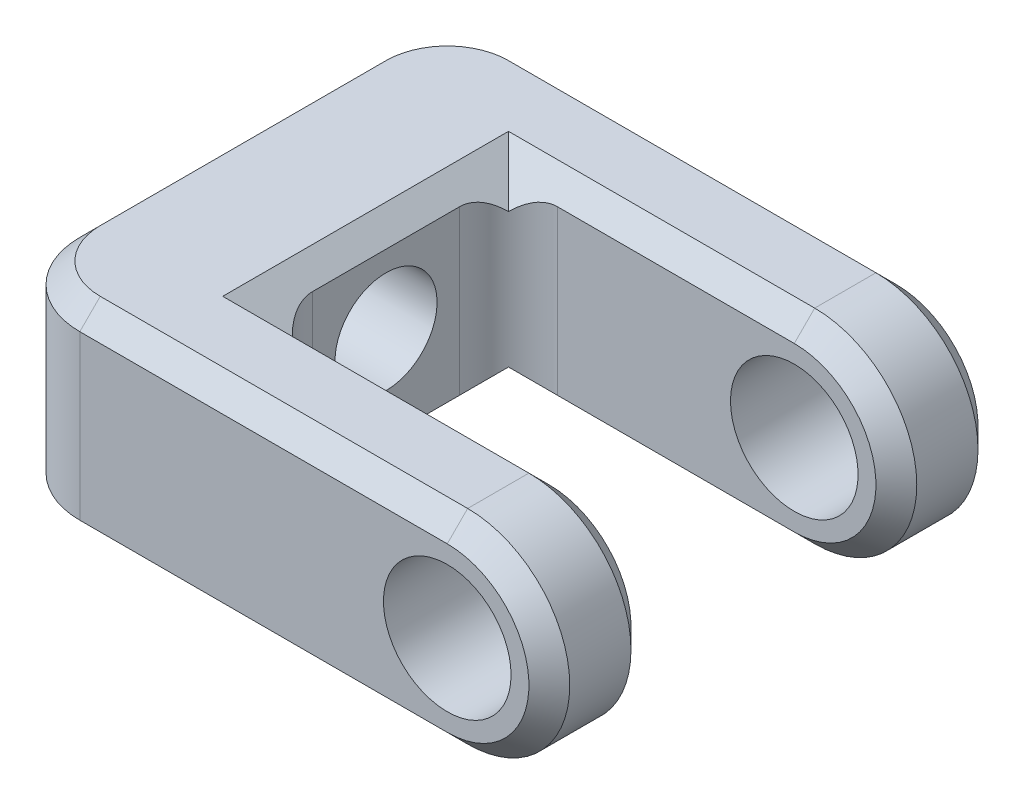
ISO-10303-21;
HEADER;
FILE_DESCRIPTION(('STEP AP214'),'2;1');
FILE_NAME('part.step','',(''),(''),'','','');
FILE_SCHEMA(('AUTOMOTIVE_DESIGN { 1 0 10303 214 1 1 1 1 }'));
ENDSEC;
DATA;
#1=APPLICATION_CONTEXT('core data for automotive mechanical design processes');
#2=APPLICATION_PROTOCOL_DEFINITION('international standard','automotive_design',2000,#1);
#3=PRODUCT_CONTEXT('',#1,'mechanical');
#4=PRODUCT('Part','Part','',(#3));
#5=PRODUCT_RELATED_PRODUCT_CATEGORY('part','',(#4));
#6=PRODUCT_DEFINITION_FORMATION('','',#4);
#7=PRODUCT_DEFINITION_CONTEXT('part definition',#1,'design');
#8=PRODUCT_DEFINITION('design','',#6,#7);
#9=PRODUCT_DEFINITION_SHAPE('','',#8);
#10=(LENGTH_UNIT() NAMED_UNIT(*) SI_UNIT(.MILLI.,.METRE.));
#11=(NAMED_UNIT(*) PLANE_ANGLE_UNIT() SI_UNIT($,.RADIAN.));
#12=(NAMED_UNIT(*) SI_UNIT($,.STERADIAN.) SOLID_ANGLE_UNIT());
#13=UNCERTAINTY_MEASURE_WITH_UNIT(LENGTH_MEASURE(1.E-05),#10,'distance_accuracy_value','');
#14=(GEOMETRIC_REPRESENTATION_CONTEXT(3) GLOBAL_UNCERTAINTY_ASSIGNED_CONTEXT((#13)) GLOBAL_UNIT_ASSIGNED_CONTEXT((#10,
#11,#12)) REPRESENTATION_CONTEXT('',''));
#15=CARTESIAN_POINT('',(0.,0.,0.));
#16=DIRECTION('',(0.,0.,1.));
#17=DIRECTION('',(1.,0.,0.));
#18=AXIS2_PLACEMENT_3D('',#15,#16,#17);
#19=CARTESIAN_POINT('',(34.925,7.9375,34.925));
#20=DIRECTION('',(0.,0.,-1.));
#21=DIRECTION('',(-1.,0.,0.));
#22=AXIS2_PLACEMENT_3D('',#19,#20,#21);
#23=CYLINDRICAL_SURFACE('',#22,7.9375);
#24=DIRECTION('',(0.,0.,-1.));
#25=VECTOR('',#24,1.);
#26=CARTESIAN_POINT('',(34.925,15.875,34.925));
#27=LINE('',#26,#25);
#28=CARTESIAN_POINT('',(34.925,15.875,6.34999999999999));
#29=VERTEX_POINT('',#28);
#30=CARTESIAN_POINT('',(34.925,15.875,1.58750000000001));
#31=VERTEX_POINT('',#30);
#32=EDGE_CURVE('E207',#29,#31,#27,.T.);
#33=ORIENTED_EDGE('',*,*,#32,.F.);
#34=CARTESIAN_POINT('',(34.925,7.9375,6.34999999999999));
#35=DIRECTION('',(0.,0.,-1.));
#36=DIRECTION('',(-1.,0.,0.));
#37=AXIS2_PLACEMENT_3D('',#34,#35,#36);
#38=CIRCLE('',#37,7.9375);
#39=CARTESIAN_POINT('',(34.925,0.,6.34999999999999));
#40=VERTEX_POINT('',#39);
#41=EDGE_CURVE('E202',#29,#40,#38,.T.);
#42=ORIENTED_EDGE('',*,*,#41,.T.);
#43=DIRECTION('',(0.,0.,-1.));
#44=VECTOR('',#43,1.);
#45=CARTESIAN_POINT('',(34.925,0.,34.925));
#46=LINE('',#45,#44);
#47=CARTESIAN_POINT('',(34.925,0.,1.58750000000001));
#48=VERTEX_POINT('',#47);
#49=EDGE_CURVE('E204',#40,#48,#46,.T.);
#50=ORIENTED_EDGE('',*,*,#49,.T.);
#51=CARTESIAN_POINT('',(34.925,7.9375,1.58750000000001));
#52=DIRECTION('',(0.,0.,1.));
#53=DIRECTION('',(1.,0.,0.));
#54=AXIS2_PLACEMENT_3D('',#51,#52,#53);
#55=CIRCLE('',#54,7.9375);
#56=EDGE_CURVE('E213',#48,#31,#55,.T.);
#57=ORIENTED_EDGE('',*,*,#56,.T.);
#58=EDGE_LOOP('',(#33,#42,#50,#57));
#59=FACE_BOUND('',#58,.T.);
#60=ADVANCED_FACE('F39',(#59),#23,.T.);
#61=CARTESIAN_POINT('',(34.925,7.9375,34.925));
#62=DIRECTION('',(0.,0.,-1.));
#63=DIRECTION('',(-1.,0.,0.));
#64=AXIS2_PLACEMENT_3D('',#61,#62,#63);
#65=CYLINDRICAL_SURFACE('',#64,4.9609375);
#66=CARTESIAN_POINT('',(34.925,7.9375,7.9375));
#67=DIRECTION('',(0.,0.,-1.));
#68=DIRECTION('',(-1.,0.,0.));
#69=AXIS2_PLACEMENT_3D('',#66,#67,#68);
#70=CIRCLE('',#69,4.9609375);
#71=CARTESIAN_POINT('',(29.9640625,7.9375,7.9375));
#72=VERTEX_POINT('',#71);
#73=EDGE_CURVE('E423',#72,#72,#70,.T.);
#74=ORIENTED_EDGE('',*,*,#73,.F.);
#75=EDGE_LOOP('',(#74));
#76=FACE_BOUND('',#75,.T.);
#77=CARTESIAN_POINT('',(34.925,7.9375,0.));
#78=DIRECTION('',(0.,0.,1.));
#79=DIRECTION('',(1.,0.,0.));
#80=AXIS2_PLACEMENT_3D('',#77,#78,#79);
#81=CIRCLE('',#80,4.9609375);
#82=CARTESIAN_POINT('',(39.8859375,7.9375,0.));
#83=VERTEX_POINT('',#82);
#84=EDGE_CURVE('E427',#83,#83,#81,.T.);
#85=ORIENTED_EDGE('',*,*,#84,.F.);
#86=EDGE_LOOP('',(#85));
#87=FACE_BOUND('',#86,.T.);
#88=ADVANCED_FACE('F485',(#76,#87),#65,.F.);
#89=CARTESIAN_POINT('',(34.925,7.9375,34.925));
#90=DIRECTION('',(0.,0.,1.));
#91=DIRECTION('',(1.,0.,0.));
#92=AXIS2_PLACEMENT_3D('',#89,#90,#91);
#93=PLANE('',#92);
#94=DIRECTION('',(0.,-1.,0.));
#95=VECTOR('',#94,1.);
#96=CARTESIAN_POINT('',(6.35,0.,34.925));
#97=LINE('',#96,#95);
#98=CARTESIAN_POINT('',(6.35,14.2875,34.925));
#99=VERTEX_POINT('',#98);
#100=CARTESIAN_POINT('',(6.35,1.58750000000001,34.925));
#101=VERTEX_POINT('',#100);
#102=EDGE_CURVE('E435',#99,#101,#97,.T.);
#103=ORIENTED_EDGE('',*,*,#102,.T.);
#104=DIRECTION('',(1.,0.,0.));
#105=VECTOR('',#104,1.);
#106=CARTESIAN_POINT('',(34.925,1.58750000000001,34.925));
#107=LINE('',#106,#105);
#108=CARTESIAN_POINT('',(34.925,1.58750000000001,34.925));
#109=VERTEX_POINT('',#108);
#110=EDGE_CURVE('E269',#101,#109,#107,.T.);
#111=ORIENTED_EDGE('',*,*,#110,.T.);
#112=CARTESIAN_POINT('',(34.925,7.9375,34.925));
#113=DIRECTION('',(0.,0.,1.));
#114=DIRECTION('',(1.,0.,0.));
#115=AXIS2_PLACEMENT_3D('',#112,#113,#114);
#116=CIRCLE('',#115,6.34999999999999);
#117=CARTESIAN_POINT('',(34.925,14.2875,34.925));
#118=VERTEX_POINT('',#117);
#119=EDGE_CURVE('E267',#109,#118,#116,.T.);
#120=ORIENTED_EDGE('',*,*,#119,.T.);
#121=DIRECTION('',(-1.,0.,0.));
#122=VECTOR('',#121,1.);
#123=CARTESIAN_POINT('',(6.35,14.2875,34.925));
#124=LINE('',#123,#122);
#125=EDGE_CURVE('E265',#118,#99,#124,.T.);
#126=ORIENTED_EDGE('',*,*,#125,.T.);
#127=EDGE_LOOP('',(#103,#111,#120,#126));
#128=FACE_BOUND('',#127,.T.);
#129=CARTESIAN_POINT('',(34.925,7.9375,34.925));
#130=DIRECTION('',(0.,0.,1.));
#131=DIRECTION('',(1.,0.,0.));
#132=AXIS2_PLACEMENT_3D('',#129,#130,#131);
#133=CIRCLE('',#132,4.9609375);
#134=CARTESIAN_POINT('',(39.8859375,7.9375,34.925));
#135=VERTEX_POINT('',#134);
#136=EDGE_CURVE('E729',#135,#135,#133,.T.);
#137=ORIENTED_EDGE('',*,*,#136,.F.);
#138=EDGE_LOOP('',(#137));
#139=FACE_BOUND('',#138,.T.);
#140=ADVANCED_FACE('F461',(#128,#139),#93,.T.);
#141=CARTESIAN_POINT('',(34.925,7.9375,0.));
#142=DIRECTION('',(0.,0.,1.));
#143=DIRECTION('',(1.,0.,0.));
#144=AXIS2_PLACEMENT_3D('',#141,#142,#143);
#145=PLANE('',#144);
#146=CARTESIAN_POINT('',(34.925,7.9375,0.));
#147=DIRECTION('',(0.,0.,1.));
#148=DIRECTION('',(1.,0.,0.));
#149=AXIS2_PLACEMENT_3D('',#146,#147,#148);
#150=CIRCLE('',#149,6.34999999999999);
#151=CARTESIAN_POINT('',(34.925,14.2875,0.));
#152=VERTEX_POINT('',#151);
#153=CARTESIAN_POINT('',(34.925,1.58750000000001,0.));
#154=VERTEX_POINT('',#153);
#155=EDGE_CURVE('E278',#152,#154,#150,.F.);
#156=ORIENTED_EDGE('',*,*,#155,.T.);
#157=DIRECTION('',(-1.,0.,0.));
#158=VECTOR('',#157,1.);
#159=CARTESIAN_POINT('',(34.925,1.58750000000001,0.));
#160=LINE('',#159,#158);
#161=CARTESIAN_POINT('',(6.35,1.58750000000001,0.));
#162=VERTEX_POINT('',#161);
#163=EDGE_CURVE('E280',#154,#162,#160,.T.);
#164=ORIENTED_EDGE('',*,*,#163,.T.);
#165=DIRECTION('',(0.,-1.,0.));
#166=VECTOR('',#165,1.);
#167=CARTESIAN_POINT('',(6.35,7.9375,0.));
#168=LINE('',#167,#166);
#169=CARTESIAN_POINT('',(6.35,14.2875,0.));
#170=VERTEX_POINT('',#169);
#171=EDGE_CURVE('E432',#162,#170,#168,.F.);
#172=ORIENTED_EDGE('',*,*,#171,.T.);
#173=DIRECTION('',(1.,0.,0.));
#174=VECTOR('',#173,1.);
#175=CARTESIAN_POINT('',(34.925,14.2875,0.));
#176=LINE('',#175,#174);
#177=EDGE_CURVE('E276',#170,#152,#176,.T.);
#178=ORIENTED_EDGE('',*,*,#177,.T.);
#179=EDGE_LOOP('',(#156,#164,#172,#178));
#180=FACE_BOUND('',#179,.T.);
#181=ORIENTED_EDGE('',*,*,#84,.T.);
#182=EDGE_LOOP('',(#181));
#183=FACE_BOUND('',#182,.T.);
#184=ADVANCED_FACE('F508',(#180,#183),#145,.F.);
#185=CARTESIAN_POINT('',(0.,0.,34.925));
#186=DIRECTION('',(1.,0.,0.));
#187=DIRECTION('',(0.,0.,-1.));
#188=AXIS2_PLACEMENT_3D('',#185,#186,#187);
#189=PLANE('',#188);
#190=CARTESIAN_POINT('',(0.,8.73125,17.4625));
#191=DIRECTION('',(-1.,0.,0.));
#192=DIRECTION('',(0.,0.,1.));
#193=AXIS2_PLACEMENT_3D('',#190,#191,#192);
#194=CIRCLE('',#193,3.96875);
#195=CARTESIAN_POINT('',(0.,8.73125,21.43125));
#196=VERTEX_POINT('',#195);
#197=EDGE_CURVE('E325',#196,#196,#194,.T.);
#198=ORIENTED_EDGE('',*,*,#197,.F.);
#199=EDGE_LOOP('',(#198));
#200=FACE_BOUND('',#199,.T.);
#201=DIRECTION('',(0.,-1.,0.));
#202=VECTOR('',#201,1.);
#203=CARTESIAN_POINT('',(0.,0.,6.35));
#204=LINE('',#203,#202);
#205=CARTESIAN_POINT('',(0.,14.2875,6.35));
#206=VERTEX_POINT('',#205);
#207=CARTESIAN_POINT('',(0.,1.58750000000001,6.35));
#208=VERTEX_POINT('',#207);
#209=EDGE_CURVE('E415',#206,#208,#204,.T.);
#210=ORIENTED_EDGE('',*,*,#209,.T.);
#211=DIRECTION('',(0.,0.,1.));
#212=VECTOR('',#211,1.);
#213=CARTESIAN_POINT('',(0.,1.58750000000001,34.925));
#214=LINE('',#213,#212);
#215=CARTESIAN_POINT('',(0.,1.58750000000001,28.575));
#216=VERTEX_POINT('',#215);
#217=EDGE_CURVE('E288',#208,#216,#214,.T.);
#218=ORIENTED_EDGE('',*,*,#217,.T.);
#219=DIRECTION('',(0.,-1.,0.));
#220=VECTOR('',#219,1.);
#221=CARTESIAN_POINT('',(0.,15.875,28.575));
#222=LINE('',#221,#220);
#223=CARTESIAN_POINT('',(0.,14.2875,28.575));
#224=VERTEX_POINT('',#223);
#225=EDGE_CURVE('E413',#216,#224,#222,.F.);
#226=ORIENTED_EDGE('',*,*,#225,.T.);
#227=DIRECTION('',(0.,0.,-1.));
#228=VECTOR('',#227,1.);
#229=CARTESIAN_POINT('',(0.,14.2875,34.925));
#230=LINE('',#229,#228);
#231=EDGE_CURVE('E286',#224,#206,#230,.T.);
#232=ORIENTED_EDGE('',*,*,#231,.T.);
#233=EDGE_LOOP('',(#210,#218,#226,#232));
#234=FACE_BOUND('',#233,.T.);
#235=ADVANCED_FACE('F504',(#200,#234),#189,.F.);
#236=CARTESIAN_POINT('',(0.,0.,34.925));
#237=DIRECTION('',(0.,1.,0.));
#238=DIRECTION('',(0.,0.,1.));
#239=AXIS2_PLACEMENT_3D('',#236,#237,#238);
#240=PLANE('',#239);
#241=DIRECTION('',(0.,0.,1.));
#242=VECTOR('',#241,1.);
#243=CARTESIAN_POINT('',(11.1125,0.,34.925));
#244=LINE('',#243,#242);
#245=CARTESIAN_POINT('',(11.1125,0.,6.34999999999999));
#246=VERTEX_POINT('',#245);
#247=CARTESIAN_POINT('',(11.1125,0.,28.575));
#248=VERTEX_POINT('',#247);
#249=EDGE_CURVE('E234',#246,#248,#244,.T.);
#250=ORIENTED_EDGE('',*,*,#249,.T.);
#251=DIRECTION('',(1.,0.,0.));
#252=VECTOR('',#251,1.);
#253=CARTESIAN_POINT('',(0.,0.,28.575));
#254=LINE('',#253,#252);
#255=CARTESIAN_POINT('',(34.925,0.,28.575));
#256=VERTEX_POINT('',#255);
#257=EDGE_CURVE('E237',#248,#256,#254,.T.);
#258=ORIENTED_EDGE('',*,*,#257,.T.);
#259=CARTESIAN_POINT('',(34.925,0.,33.3375));
#260=VERTEX_POINT('',#259);
#261=EDGE_CURVE('E221',#260,#256,#46,.T.);
#262=ORIENTED_EDGE('',*,*,#261,.F.);
#263=DIRECTION('',(-1.,0.,0.));
#264=VECTOR('',#263,1.);
#265=CARTESIAN_POINT('',(6.35,0.,33.3375));
#266=LINE('',#265,#264);
#267=CARTESIAN_POINT('',(6.35,0.,33.3375));
#268=VERTEX_POINT('',#267);
#269=EDGE_CURVE('E235',#260,#268,#266,.T.);
#270=ORIENTED_EDGE('',*,*,#269,.T.);
#271=CARTESIAN_POINT('',(6.35,0.,28.575));
#272=DIRECTION('',(0.,1.,0.));
#273=DIRECTION('',(0.,0.,1.));
#274=AXIS2_PLACEMENT_3D('',#271,#272,#273);
#275=CIRCLE('',#274,4.76249999999999);
#276=CARTESIAN_POINT('',(1.58750000000001,0.,28.575));
#277=VERTEX_POINT('',#276);
#278=EDGE_CURVE('E240',#268,#277,#275,.F.);
#279=ORIENTED_EDGE('',*,*,#278,.T.);
#280=DIRECTION('',(0.,0.,-1.));
#281=VECTOR('',#280,1.);
#282=CARTESIAN_POINT('',(1.58750000000001,0.,34.925));
#283=LINE('',#282,#281);
#284=CARTESIAN_POINT('',(1.58750000000001,0.,6.35));
#285=VERTEX_POINT('',#284);
#286=EDGE_CURVE('E438',#277,#285,#283,.T.);
#287=ORIENTED_EDGE('',*,*,#286,.T.);
#288=CARTESIAN_POINT('',(6.35,0.,6.35));
#289=DIRECTION('',(0.,1.,0.));
#290=DIRECTION('',(0.,0.,1.));
#291=AXIS2_PLACEMENT_3D('',#288,#289,#290);
#292=CIRCLE('',#291,4.76249999999999);
#293=CARTESIAN_POINT('',(6.35,0.,1.58750000000001));
#294=VERTEX_POINT('',#293);
#295=EDGE_CURVE('E440',#285,#294,#292,.F.);
#296=ORIENTED_EDGE('',*,*,#295,.T.);
#297=DIRECTION('',(1.,0.,0.));
#298=VECTOR('',#297,1.);
#299=CARTESIAN_POINT('',(0.,0.,1.58750000000001));
#300=LINE('',#299,#298);
#301=EDGE_CURVE('E220',#294,#48,#300,.T.);
#302=ORIENTED_EDGE('',*,*,#301,.T.);
#303=ORIENTED_EDGE('',*,*,#49,.F.);
#304=DIRECTION('',(-1.,0.,0.));
#305=VECTOR('',#304,1.);
#306=CARTESIAN_POINT('',(0.,0.,6.34999999999999));
#307=LINE('',#306,#305);
#308=EDGE_CURVE('E218',#40,#246,#307,.T.);
#309=ORIENTED_EDGE('',*,*,#308,.T.);
#310=EDGE_LOOP('',(#250,#258,#262,#270,#279,#287,#296,#302,#303,#309));
#311=FACE_BOUND('',#310,.T.);
#312=ADVANCED_FACE('F216',(#311),#240,.F.);
#313=ORIENTED_EDGE('',*,*,#261,.T.);
#314=CARTESIAN_POINT('',(34.925,7.9375,28.575));
#315=DIRECTION('',(0.,0.,1.));
#316=DIRECTION('',(1.,0.,0.));
#317=AXIS2_PLACEMENT_3D('',#314,#315,#316);
#318=CIRCLE('',#317,7.9375);
#319=CARTESIAN_POINT('',(34.925,15.875,28.575));
#320=VERTEX_POINT('',#319);
#321=EDGE_CURVE('E292',#256,#320,#318,.T.);
#322=ORIENTED_EDGE('',*,*,#321,.T.);
#323=CARTESIAN_POINT('',(34.925,15.875,33.3375));
#324=VERTEX_POINT('',#323);
#325=EDGE_CURVE('E222',#324,#320,#27,.T.);
#326=ORIENTED_EDGE('',*,*,#325,.F.);
#327=CARTESIAN_POINT('',(34.925,7.9375,33.3375));
#328=DIRECTION('',(0.,0.,1.));
#329=DIRECTION('',(1.,0.,0.));
#330=AXIS2_PLACEMENT_3D('',#327,#328,#329);
#331=CIRCLE('',#330,7.9375);
#332=EDGE_CURVE('E212',#324,#260,#331,.F.);
#333=ORIENTED_EDGE('',*,*,#332,.T.);
#334=EDGE_LOOP('',(#313,#322,#326,#333));
#335=FACE_BOUND('',#334,.T.);
#336=ADVANCED_FACE('F409',(#335),#23,.T.);
#337=CARTESIAN_POINT('',(0.,15.875,34.925));
#338=DIRECTION('',(0.,-1.,0.));
#339=DIRECTION('',(0.,0.,-1.));
#340=AXIS2_PLACEMENT_3D('',#337,#338,#339);
#341=PLANE('',#340);
#342=DIRECTION('',(0.,0.,-1.));
#343=VECTOR('',#342,1.);
#344=CARTESIAN_POINT('',(11.1125,15.875,34.925));
#345=LINE('',#344,#343);
#346=CARTESIAN_POINT('',(11.1125,15.875,28.575));
#347=VERTEX_POINT('',#346);
#348=CARTESIAN_POINT('',(11.1125,15.875,6.34999999999999));
#349=VERTEX_POINT('',#348);
#350=EDGE_CURVE('E306',#347,#349,#345,.T.);
#351=ORIENTED_EDGE('',*,*,#350,.T.);
#352=DIRECTION('',(1.,0.,0.));
#353=VECTOR('',#352,1.);
#354=CARTESIAN_POINT('',(0.,15.875,6.34999999999999));
#355=LINE('',#354,#353);
#356=EDGE_CURVE('E308',#349,#29,#355,.T.);
#357=ORIENTED_EDGE('',*,*,#356,.T.);
#358=ORIENTED_EDGE('',*,*,#32,.T.);
#359=DIRECTION('',(-1.,0.,0.));
#360=VECTOR('',#359,1.);
#361=CARTESIAN_POINT('',(0.,15.875,1.58750000000001));
#362=LINE('',#361,#360);
#363=CARTESIAN_POINT('',(6.35,15.875,1.58750000000001));
#364=VERTEX_POINT('',#363);
#365=EDGE_CURVE('E294',#31,#364,#362,.T.);
#366=ORIENTED_EDGE('',*,*,#365,.T.);
#367=CARTESIAN_POINT('',(6.35,15.875,6.35));
#368=DIRECTION('',(0.,-1.,0.));
#369=DIRECTION('',(0.,0.,-1.));
#370=AXIS2_PLACEMENT_3D('',#367,#368,#369);
#371=CIRCLE('',#370,4.76249999999999);
#372=CARTESIAN_POINT('',(1.58750000000001,15.875,6.35));
#373=VERTEX_POINT('',#372);
#374=EDGE_CURVE('E296',#364,#373,#371,.F.);
#375=ORIENTED_EDGE('',*,*,#374,.T.);
#376=DIRECTION('',(0.,0.,1.));
#377=VECTOR('',#376,1.);
#378=CARTESIAN_POINT('',(1.58750000000001,15.875,34.925));
#379=LINE('',#378,#377);
#380=CARTESIAN_POINT('',(1.58750000000001,15.875,28.575));
#381=VERTEX_POINT('',#380);
#382=EDGE_CURVE('E298',#373,#381,#379,.T.);
#383=ORIENTED_EDGE('',*,*,#382,.T.);
#384=CARTESIAN_POINT('',(6.35,15.875,28.575));
#385=DIRECTION('',(0.,-1.,0.));
#386=DIRECTION('',(0.,0.,-1.));
#387=AXIS2_PLACEMENT_3D('',#384,#385,#386);
#388=CIRCLE('',#387,4.7625);
#389=CARTESIAN_POINT('',(6.35,15.875,33.3375));
#390=VERTEX_POINT('',#389);
#391=EDGE_CURVE('E300',#381,#390,#388,.F.);
#392=ORIENTED_EDGE('',*,*,#391,.T.);
#393=DIRECTION('',(1.,0.,0.));
#394=VECTOR('',#393,1.);
#395=CARTESIAN_POINT('',(34.925,15.875,33.3375));
#396=LINE('',#395,#394);
#397=EDGE_CURVE('E302',#390,#324,#396,.T.);
#398=ORIENTED_EDGE('',*,*,#397,.T.);
#399=ORIENTED_EDGE('',*,*,#325,.T.);
#400=DIRECTION('',(-1.,0.,0.));
#401=VECTOR('',#400,1.);
#402=CARTESIAN_POINT('',(0.,15.875,28.575));
#403=LINE('',#402,#401);
#404=EDGE_CURVE('E304',#320,#347,#403,.T.);
#405=ORIENTED_EDGE('',*,*,#404,.T.);
#406=EDGE_LOOP('',(#351,#357,#358,#366,#375,#383,#392,#398,#399,#405));
#407=FACE_BOUND('',#406,.T.);
#408=ADVANCED_FACE('F498',(#407),#341,.F.);
#409=CARTESIAN_POINT('',(34.925,7.9375,26.9875));
#410=DIRECTION('',(0.,0.,1.));
#411=DIRECTION('',(1.,0.,0.));
#412=AXIS2_PLACEMENT_3D('',#409,#410,#411);
#413=CIRCLE('',#412,4.9609375);
#414=CARTESIAN_POINT('',(39.8859375,7.9375,26.9875));
#415=VERTEX_POINT('',#414);
#416=EDGE_CURVE('E420',#415,#415,#413,.T.);
#417=ORIENTED_EDGE('',*,*,#416,.F.);
#418=EDGE_LOOP('',(#417));
#419=FACE_BOUND('',#418,.T.);
#420=ORIENTED_EDGE('',*,*,#136,.T.);
#421=EDGE_LOOP('',(#420));
#422=FACE_BOUND('',#421,.T.);
#423=ADVANCED_FACE('F494',(#419,#422),#65,.F.);
#424=CARTESIAN_POINT('',(12.7,0.,7.9375));
#425=DIRECTION('',(0.,0.,-1.));
#426=DIRECTION('',(-1.,0.,0.));
#427=AXIS2_PLACEMENT_3D('',#424,#425,#426);
#428=PLANE('',#427);
#429=ORIENTED_EDGE('',*,*,#73,.T.);
#430=EDGE_LOOP('',(#429));
#431=FACE_BOUND('',#430,.T.);
#432=DIRECTION('',(-1.,0.,0.));
#433=VECTOR('',#432,1.);
#434=CARTESIAN_POINT('',(12.7,14.2875,7.9375));
#435=LINE('',#434,#433);
#436=CARTESIAN_POINT('',(34.925,14.2875,7.9375));
#437=VERTEX_POINT('',#436);
#438=CARTESIAN_POINT('',(16.51,14.2875,7.9375));
#439=VERTEX_POINT('',#438);
#440=EDGE_CURVE('E259',#437,#439,#435,.T.);
#441=ORIENTED_EDGE('',*,*,#440,.T.);
#442=DIRECTION('',(0.,1.,0.));
#443=VECTOR('',#442,1.);
#444=CARTESIAN_POINT('',(16.51,1.58750000000001,7.9375));
#445=LINE('',#444,#443);
#446=CARTESIAN_POINT('',(16.51,1.58750000000001,7.9375));
#447=VERTEX_POINT('',#446);
#448=EDGE_CURVE('E366',#439,#447,#445,.F.);
#449=ORIENTED_EDGE('',*,*,#448,.T.);
#450=DIRECTION('',(1.,0.,0.));
#451=VECTOR('',#450,1.);
#452=CARTESIAN_POINT('',(12.7,1.58750000000001,7.9375));
#453=LINE('',#452,#451);
#454=CARTESIAN_POINT('',(34.925,1.5875,7.9375));
#455=VERTEX_POINT('',#454);
#456=EDGE_CURVE('E263',#447,#455,#453,.T.);
#457=ORIENTED_EDGE('',*,*,#456,.T.);
#458=CARTESIAN_POINT('',(34.925,7.9375,7.9375));
#459=DIRECTION('',(0.,0.,-1.));
#460=DIRECTION('',(-1.,0.,0.));
#461=AXIS2_PLACEMENT_3D('',#458,#459,#460);
#462=CIRCLE('',#461,6.35);
#463=EDGE_CURVE('E228',#455,#437,#462,.F.);
#464=ORIENTED_EDGE('',*,*,#463,.T.);
#465=EDGE_LOOP('',(#441,#449,#457,#464));
#466=FACE_BOUND('',#465,.T.);
#467=ADVANCED_FACE('F685',(#431,#466),#428,.F.);
#468=CARTESIAN_POINT('',(12.7,0.,26.9875));
#469=DIRECTION('',(0.,0.,1.));
#470=DIRECTION('',(1.,0.,0.));
#471=AXIS2_PLACEMENT_3D('',#468,#469,#470);
#472=PLANE('',#471);
#473=ORIENTED_EDGE('',*,*,#416,.T.);
#474=EDGE_LOOP('',(#473));
#475=FACE_BOUND('',#474,.T.);
#476=DIRECTION('',(-1.,0.,0.));
#477=VECTOR('',#476,1.);
#478=CARTESIAN_POINT('',(12.7,1.58750000000001,26.9875));
#479=LINE('',#478,#477);
#480=CARTESIAN_POINT('',(34.925,1.5875,26.9875));
#481=VERTEX_POINT('',#480);
#482=CARTESIAN_POINT('',(16.51,1.58750000000001,26.9875));
#483=VERTEX_POINT('',#482);
#484=EDGE_CURVE('E250',#481,#483,#479,.T.);
#485=ORIENTED_EDGE('',*,*,#484,.T.);
#486=DIRECTION('',(0.,1.,0.));
#487=VECTOR('',#486,1.);
#488=CARTESIAN_POINT('',(16.51,14.2875,26.9875));
#489=LINE('',#488,#487);
#490=CARTESIAN_POINT('',(16.51,14.2875,26.9875));
#491=VERTEX_POINT('',#490);
#492=EDGE_CURVE('E310',#483,#491,#489,.T.);
#493=ORIENTED_EDGE('',*,*,#492,.T.);
#494=DIRECTION('',(1.,0.,0.));
#495=VECTOR('',#494,1.);
#496=CARTESIAN_POINT('',(12.7,14.2875,26.9875));
#497=LINE('',#496,#495);
#498=CARTESIAN_POINT('',(34.925,14.2875,26.9875));
#499=VERTEX_POINT('',#498);
#500=EDGE_CURVE('E246',#491,#499,#497,.T.);
#501=ORIENTED_EDGE('',*,*,#500,.T.);
#502=CARTESIAN_POINT('',(34.925,7.9375,26.9875));
#503=DIRECTION('',(0.,0.,1.));
#504=DIRECTION('',(1.,0.,0.));
#505=AXIS2_PLACEMENT_3D('',#502,#503,#504);
#506=CIRCLE('',#505,6.35);
#507=EDGE_CURVE('E248',#499,#481,#506,.F.);
#508=ORIENTED_EDGE('',*,*,#507,.T.);
#509=EDGE_LOOP('',(#485,#493,#501,#508));
#510=FACE_BOUND('',#509,.T.);
#511=ADVANCED_FACE('F697',(#475,#510),#472,.F.);
#512=CARTESIAN_POINT('',(12.7,0.,7.9375));
#513=DIRECTION('',(-1.,0.,0.));
#514=DIRECTION('',(0.,0.,1.));
#515=AXIS2_PLACEMENT_3D('',#512,#513,#514);
#516=PLANE('',#515);
#517=CARTESIAN_POINT('',(12.7,8.73125,17.4625));
#518=DIRECTION('',(-1.,0.,0.));
#519=DIRECTION('',(0.,0.,1.));
#520=AXIS2_PLACEMENT_3D('',#517,#518,#519);
#521=CIRCLE('',#520,3.96875);
#522=CARTESIAN_POINT('',(12.7,8.73125,21.43125));
#523=VERTEX_POINT('',#522);
#524=EDGE_CURVE('E424',#523,#523,#521,.T.);
#525=ORIENTED_EDGE('',*,*,#524,.T.);
#526=EDGE_LOOP('',(#525));
#527=FACE_BOUND('',#526,.T.);
#528=DIRECTION('',(0.,0.,1.));
#529=VECTOR('',#528,1.);
#530=CARTESIAN_POINT('',(12.7,14.2875,7.9375));
#531=LINE('',#530,#529);
#532=CARTESIAN_POINT('',(12.7,14.2875,11.7475));
#533=VERTEX_POINT('',#532);
#534=CARTESIAN_POINT('',(12.7,14.2875,23.1775));
#535=VERTEX_POINT('',#534);
#536=EDGE_CURVE('E253',#533,#535,#531,.T.);
#537=ORIENTED_EDGE('',*,*,#536,.T.);
#538=DIRECTION('',(0.,1.,0.));
#539=VECTOR('',#538,1.);
#540=CARTESIAN_POINT('',(12.7,1.58750000000001,23.1775));
#541=LINE('',#540,#539);
#542=CARTESIAN_POINT('',(12.7,1.58750000000001,23.1775));
#543=VERTEX_POINT('',#542);
#544=EDGE_CURVE('E364',#535,#543,#541,.F.);
#545=ORIENTED_EDGE('',*,*,#544,.T.);
#546=DIRECTION('',(0.,0.,-1.));
#547=VECTOR('',#546,1.);
#548=CARTESIAN_POINT('',(12.7,1.58750000000001,7.9375));
#549=LINE('',#548,#547);
#550=CARTESIAN_POINT('',(12.7,1.58750000000001,11.7475));
#551=VERTEX_POINT('',#550);
#552=EDGE_CURVE('E256',#543,#551,#549,.T.);
#553=ORIENTED_EDGE('',*,*,#552,.T.);
#554=DIRECTION('',(0.,1.,0.));
#555=VECTOR('',#554,1.);
#556=CARTESIAN_POINT('',(12.7,14.2875,11.7475));
#557=LINE('',#556,#555);
#558=EDGE_CURVE('E361',#551,#533,#557,.T.);
#559=ORIENTED_EDGE('',*,*,#558,.T.);
#560=EDGE_LOOP('',(#537,#545,#553,#559));
#561=FACE_BOUND('',#560,.T.);
#562=ADVANCED_FACE('F390',(#527,#561),#516,.F.);
#563=CARTESIAN_POINT('',(42.8625,8.73125,17.4625));
#564=DIRECTION('',(-1.,0.,0.));
#565=DIRECTION('',(0.,0.,1.));
#566=AXIS2_PLACEMENT_3D('',#563,#564,#565);
#567=CYLINDRICAL_SURFACE('',#566,3.96875);
#568=ORIENTED_EDGE('',*,*,#197,.T.);
#569=EDGE_LOOP('',(#568));
#570=FACE_BOUND('',#569,.T.);
#571=ORIENTED_EDGE('',*,*,#524,.F.);
#572=EDGE_LOOP('',(#571));
#573=FACE_BOUND('',#572,.T.);
#574=ADVANCED_FACE('F515',(#570,#573),#567,.F.);
#575=CARTESIAN_POINT('',(6.35,0.,6.35));
#576=DIRECTION('',(0.,-1.,0.));
#577=DIRECTION('',(0.,0.,-1.));
#578=AXIS2_PLACEMENT_3D('',#575,#576,#577);
#579=CYLINDRICAL_SURFACE('',#578,6.35);
#580=ORIENTED_EDGE('',*,*,#171,.F.);
#581=CARTESIAN_POINT('',(6.35,1.58750000000001,6.35));
#582=DIRECTION('',(0.,1.,0.));
#583=DIRECTION('',(0.,0.,1.));
#584=AXIS2_PLACEMENT_3D('',#581,#582,#583);
#585=CIRCLE('',#584,6.35);
#586=EDGE_CURVE('E284',#162,#208,#585,.T.);
#587=ORIENTED_EDGE('',*,*,#586,.T.);
#588=ORIENTED_EDGE('',*,*,#209,.F.);
#589=CARTESIAN_POINT('',(6.35,14.2875,6.35));
#590=DIRECTION('',(0.,-1.,0.));
#591=DIRECTION('',(0.,0.,-1.));
#592=AXIS2_PLACEMENT_3D('',#589,#590,#591);
#593=CIRCLE('',#592,6.35);
#594=EDGE_CURVE('E282',#206,#170,#593,.T.);
#595=ORIENTED_EDGE('',*,*,#594,.T.);
#596=EDGE_LOOP('',(#580,#587,#588,#595));
#597=FACE_BOUND('',#596,.T.);
#598=ADVANCED_FACE('F512',(#597),#579,.T.);
#599=CARTESIAN_POINT('',(6.35,7.9375,28.575));
#600=DIRECTION('',(0.,1.,0.));
#601=DIRECTION('',(0.,0.,1.));
#602=AXIS2_PLACEMENT_3D('',#599,#600,#601);
#603=CYLINDRICAL_SURFACE('',#602,6.35);
#604=ORIENTED_EDGE('',*,*,#225,.F.);
#605=CARTESIAN_POINT('',(6.35,1.58750000000001,28.575));
#606=DIRECTION('',(0.,1.,0.));
#607=DIRECTION('',(0.,0.,1.));
#608=AXIS2_PLACEMENT_3D('',#605,#606,#607);
#609=CIRCLE('',#608,6.35);
#610=EDGE_CURVE('E274',#216,#101,#609,.T.);
#611=ORIENTED_EDGE('',*,*,#610,.T.);
#612=ORIENTED_EDGE('',*,*,#102,.F.);
#613=CARTESIAN_POINT('',(6.35,14.2875,28.575));
#614=DIRECTION('',(0.,-1.,0.));
#615=DIRECTION('',(0.,0.,-1.));
#616=AXIS2_PLACEMENT_3D('',#613,#614,#615);
#617=CIRCLE('',#616,6.35);
#618=EDGE_CURVE('E272',#99,#224,#617,.T.);
#619=ORIENTED_EDGE('',*,*,#618,.T.);
#620=EDGE_LOOP('',(#604,#611,#612,#619));
#621=FACE_BOUND('',#620,.T.);
#622=ADVANCED_FACE('F458',(#621),#603,.T.);
#623=CARTESIAN_POINT('',(12.7,14.2875,7.9375));
#624=DIRECTION('',(0.,-0.707106781186551,-0.707106781186544));
#625=DIRECTION('',(-1.,0.,0.));
#626=AXIS2_PLACEMENT_3D('',#623,#624,#625);
#627=PLANE('',#626);
#628=DIRECTION('',(-0.577350269189628,0.577350269189622,-0.577350269189627));
#629=VECTOR('',#628,1.);
#630=CARTESIAN_POINT('',(12.7,14.2875,7.9375));
#631=LINE('',#630,#629);
#632=CARTESIAN_POINT('',(13.8159231636793,13.1715768363208,9.05342316367925));
#633=VERTEX_POINT('',#632);
#634=EDGE_CURVE('E61',#633,#349,#631,.T.);
#635=ORIENTED_EDGE('',*,*,#634,.F.);
#636=CARTESIAN_POINT('',(16.51,10.4775,11.7475));
#637=DIRECTION('',(0.,-0.707106781186551,-0.707106781186544));
#638=DIRECTION('',(0.,-0.707106781186544,0.707106781186551));
#639=AXIS2_PLACEMENT_3D('',#636,#637,#638);
#640=ELLIPSE('',#639,5.38815367264147,3.81);
#641=EDGE_CURVE('E380',#633,#439,#640,.T.);
#642=ORIENTED_EDGE('',*,*,#641,.T.);
#643=ORIENTED_EDGE('',*,*,#440,.F.);
#644=DIRECTION('',(0.,-0.707106781186544,0.707106781186551));
#645=VECTOR('',#644,1.);
#646=CARTESIAN_POINT('',(34.925,15.875,6.34999999999999));
#647=LINE('',#646,#645);
#648=EDGE_CURVE('E323',#29,#437,#647,.T.);
#649=ORIENTED_EDGE('',*,*,#648,.F.);
#650=ORIENTED_EDGE('',*,*,#356,.F.);
#651=EDGE_LOOP('',(#635,#642,#643,#649,#650));
#652=FACE_BOUND('',#651,.T.);
#653=ADVANCED_FACE('F519',(#652),#627,.F.);
#654=CARTESIAN_POINT('',(34.925,7.9375,6.34999999999999));
#655=DIRECTION('',(0.,0.,-1.));
#656=DIRECTION('',(-1.,0.,0.));
#657=AXIS2_PLACEMENT_3D('',#654,#655,#656);
#658=CONICAL_SURFACE('',#657,7.9375,0.785398163397444);
#659=ORIENTED_EDGE('',*,*,#648,.T.);
#660=ORIENTED_EDGE('',*,*,#463,.F.);
#661=DIRECTION('',(0.,0.707106781186544,0.70710678118655));
#662=VECTOR('',#661,1.);
#663=CARTESIAN_POINT('',(34.925,0.,6.34999999999999));
#664=LINE('',#663,#662);
#665=EDGE_CURVE('E226',#40,#455,#664,.T.);
#666=ORIENTED_EDGE('',*,*,#665,.F.);
#667=ORIENTED_EDGE('',*,*,#41,.F.);
#668=EDGE_LOOP('',(#659,#660,#666,#667));
#669=FACE_BOUND('',#668,.T.);
#670=ADVANCED_FACE('F227',(#669),#658,.T.);
#671=CARTESIAN_POINT('',(12.7,14.2875,7.9375));
#672=DIRECTION('',(-0.707106781186544,-0.707106781186551,0.));
#673=DIRECTION('',(0.,0.,1.));
#674=AXIS2_PLACEMENT_3D('',#671,#672,#673);
#675=PLANE('',#674);
#676=ORIENTED_EDGE('',*,*,#634,.T.);
#677=ORIENTED_EDGE('',*,*,#350,.F.);
#678=DIRECTION('',(-0.577350269189628,0.577350269189622,0.577350269189627));
#679=VECTOR('',#678,1.);
#680=CARTESIAN_POINT('',(19.05,7.93750000000002,20.6375));
#681=LINE('',#680,#679);
#682=CARTESIAN_POINT('',(13.8159231636793,13.1715768363208,25.8715768363207));
#683=VERTEX_POINT('',#682);
#684=EDGE_CURVE('E231',#683,#347,#681,.T.);
#685=ORIENTED_EDGE('',*,*,#684,.F.);
#686=CARTESIAN_POINT('',(16.51,10.4775,23.1775));
#687=DIRECTION('',(-0.707106781186544,-0.707106781186551,0.));
#688=DIRECTION('',(0.707106781186551,-0.707106781186544,0.));
#689=AXIS2_PLACEMENT_3D('',#686,#687,#688);
#690=ELLIPSE('',#689,5.38815367264147,3.81);
#691=EDGE_CURVE('E371',#683,#535,#690,.T.);
#692=ORIENTED_EDGE('',*,*,#691,.T.);
#693=ORIENTED_EDGE('',*,*,#536,.F.);
#694=CARTESIAN_POINT('',(16.51,10.4775,11.7475));
#695=DIRECTION('',(-0.707106781186544,-0.707106781186551,0.));
#696=DIRECTION('',(0.707106781186551,-0.707106781186544,0.));
#697=AXIS2_PLACEMENT_3D('',#694,#695,#696);
#698=ELLIPSE('',#697,5.38815367264147,3.81);
#699=EDGE_CURVE('E378',#533,#633,#698,.T.);
#700=ORIENTED_EDGE('',*,*,#699,.T.);
#701=EDGE_LOOP('',(#676,#677,#685,#692,#693,#700));
#702=FACE_BOUND('',#701,.T.);
#703=ADVANCED_FACE('F535',(#702),#675,.F.);
#704=CARTESIAN_POINT('',(0.,0.,6.34999999999999));
#705=DIRECTION('',(0.,0.707106781186546,-0.707106781186549));
#706=DIRECTION('',(-1.,0.,0.));
#707=AXIS2_PLACEMENT_3D('',#704,#705,#706);
#708=PLANE('',#707);
#709=ORIENTED_EDGE('',*,*,#665,.T.);
#710=ORIENTED_EDGE('',*,*,#456,.F.);
#711=CARTESIAN_POINT('',(16.51,5.39750000000003,11.7475));
#712=DIRECTION('',(0.,0.707106781186546,-0.707106781186549));
#713=DIRECTION('',(0.,-0.707106781186549,-0.707106781186546));
#714=AXIS2_PLACEMENT_3D('',#711,#712,#713);
#715=ELLIPSE('',#714,5.3881536726415,3.81);
#716=CARTESIAN_POINT('',(13.8159231636793,2.70342316367927,9.05342316367925));
#717=VERTEX_POINT('',#716);
#718=EDGE_CURVE('E47',#447,#717,#715,.T.);
#719=ORIENTED_EDGE('',*,*,#718,.T.);
#720=DIRECTION('',(-0.577350269189625,-0.577350269189627,-0.577350269189625));
#721=VECTOR('',#720,1.);
#722=CARTESIAN_POINT('',(20.6375,9.52500000000001,15.875));
#723=LINE('',#722,#721);
#724=EDGE_CURVE('E53',#246,#717,#723,.F.);
#725=ORIENTED_EDGE('',*,*,#724,.F.);
#726=ORIENTED_EDGE('',*,*,#308,.F.);
#727=EDGE_LOOP('',(#709,#710,#719,#725,#726));
#728=FACE_BOUND('',#727,.T.);
#729=ADVANCED_FACE('F233',(#728),#708,.F.);
#730=CARTESIAN_POINT('',(12.7,14.2875,26.9875));
#731=DIRECTION('',(0.,-0.707106781186551,0.707106781186544));
#732=DIRECTION('',(1.,0.,0.));
#733=AXIS2_PLACEMENT_3D('',#730,#731,#732);
#734=PLANE('',#733);
#735=ORIENTED_EDGE('',*,*,#684,.T.);
#736=ORIENTED_EDGE('',*,*,#404,.F.);
#737=DIRECTION('',(0.,0.707106781186544,0.707106781186551));
#738=VECTOR('',#737,1.);
#739=CARTESIAN_POINT('',(34.925,14.2875,26.9875));
#740=LINE('',#739,#738);
#741=EDGE_CURVE('E316',#499,#320,#740,.T.);
#742=ORIENTED_EDGE('',*,*,#741,.F.);
#743=ORIENTED_EDGE('',*,*,#500,.F.);
#744=CARTESIAN_POINT('',(16.51,10.4775,23.1775));
#745=DIRECTION('',(0.,-0.707106781186551,0.707106781186544));
#746=DIRECTION('',(0.,-0.707106781186544,-0.707106781186551));
#747=AXIS2_PLACEMENT_3D('',#744,#745,#746);
#748=ELLIPSE('',#747,5.38815367264147,3.81);
#749=EDGE_CURVE('E368',#491,#683,#748,.T.);
#750=ORIENTED_EDGE('',*,*,#749,.T.);
#751=EDGE_LOOP('',(#735,#736,#742,#743,#750));
#752=FACE_BOUND('',#751,.T.);
#753=ADVANCED_FACE('F529',(#752),#734,.F.);
#754=CARTESIAN_POINT('',(11.1125,0.,34.925));
#755=DIRECTION('',(-0.707106781186549,0.707106781186546,0.));
#756=DIRECTION('',(0.,0.,1.));
#757=AXIS2_PLACEMENT_3D('',#754,#755,#756);
#758=PLANE('',#757);
#759=ORIENTED_EDGE('',*,*,#724,.T.);
#760=CARTESIAN_POINT('',(16.51,5.39750000000003,11.7475));
#761=DIRECTION('',(-0.707106781186549,0.707106781186546,0.));
#762=DIRECTION('',(-0.707106781186546,-0.707106781186549,0.));
#763=AXIS2_PLACEMENT_3D('',#760,#761,#762);
#764=ELLIPSE('',#763,5.3881536726415,3.81);
#765=EDGE_CURVE('E11',#717,#551,#764,.T.);
#766=ORIENTED_EDGE('',*,*,#765,.T.);
#767=ORIENTED_EDGE('',*,*,#552,.F.);
#768=CARTESIAN_POINT('',(16.51,5.39750000000003,23.1775));
#769=DIRECTION('',(-0.707106781186549,0.707106781186546,0.));
#770=DIRECTION('',(-0.707106781186546,-0.707106781186549,0.));
#771=AXIS2_PLACEMENT_3D('',#768,#769,#770);
#772=ELLIPSE('',#771,5.3881536726415,3.81);
#773=CARTESIAN_POINT('',(13.8159231636793,2.70342316367927,25.8715768363207));
#774=VERTEX_POINT('',#773);
#775=EDGE_CURVE('E373',#543,#774,#772,.T.);
#776=ORIENTED_EDGE('',*,*,#775,.T.);
#777=DIRECTION('',(-0.577350269189625,-0.577350269189627,0.577350269189625));
#778=VECTOR('',#777,1.);
#779=CARTESIAN_POINT('',(7.40833333333334,-3.70416666666667,32.2791666666667));
#780=LINE('',#779,#778);
#781=EDGE_CURVE('E313',#248,#774,#780,.F.);
#782=ORIENTED_EDGE('',*,*,#781,.F.);
#783=ORIENTED_EDGE('',*,*,#249,.F.);
#784=EDGE_LOOP('',(#759,#766,#767,#776,#782,#783));
#785=FACE_BOUND('',#784,.T.);
#786=ADVANCED_FACE('F387',(#785),#758,.F.);
#787=CARTESIAN_POINT('',(34.925,7.9375,28.575));
#788=DIRECTION('',(0.,0.,1.));
#789=DIRECTION('',(1.,0.,0.));
#790=AXIS2_PLACEMENT_3D('',#787,#788,#789);
#791=CONICAL_SURFACE('',#790,7.9375,0.785398163397444);
#792=ORIENTED_EDGE('',*,*,#741,.T.);
#793=ORIENTED_EDGE('',*,*,#321,.F.);
#794=DIRECTION('',(0.,-0.707106781186544,0.70710678118655));
#795=VECTOR('',#794,1.);
#796=CARTESIAN_POINT('',(34.925,1.5875,26.9875));
#797=LINE('',#796,#795);
#798=EDGE_CURVE('E311',#481,#256,#797,.T.);
#799=ORIENTED_EDGE('',*,*,#798,.F.);
#800=ORIENTED_EDGE('',*,*,#507,.F.);
#801=EDGE_LOOP('',(#792,#793,#799,#800));
#802=FACE_BOUND('',#801,.T.);
#803=ADVANCED_FACE('F523',(#802),#791,.T.);
#804=CARTESIAN_POINT('',(0.,0.,28.575));
#805=DIRECTION('',(0.,0.707106781186546,0.707106781186549));
#806=DIRECTION('',(1.,0.,0.));
#807=AXIS2_PLACEMENT_3D('',#804,#805,#806);
#808=PLANE('',#807);
#809=ORIENTED_EDGE('',*,*,#781,.T.);
#810=CARTESIAN_POINT('',(16.51,5.39750000000003,23.1775));
#811=DIRECTION('',(0.,0.707106781186546,0.707106781186549));
#812=DIRECTION('',(0.,-0.707106781186549,0.707106781186546));
#813=AXIS2_PLACEMENT_3D('',#810,#811,#812);
#814=ELLIPSE('',#813,5.3881536726415,3.81);
#815=EDGE_CURVE('E376',#774,#483,#814,.T.);
#816=ORIENTED_EDGE('',*,*,#815,.T.);
#817=ORIENTED_EDGE('',*,*,#484,.F.);
#818=ORIENTED_EDGE('',*,*,#798,.T.);
#819=ORIENTED_EDGE('',*,*,#257,.F.);
#820=EDGE_LOOP('',(#809,#816,#817,#818,#819));
#821=FACE_BOUND('',#820,.T.);
#822=ADVANCED_FACE('F401',(#821),#808,.F.);
#823=CARTESIAN_POINT('',(0.,15.875,1.58750000000001));
#824=DIRECTION('',(0.,-0.707106781186546,0.707106781186549));
#825=DIRECTION('',(-1.,0.,0.));
#826=AXIS2_PLACEMENT_3D('',#823,#824,#825);
#827=PLANE('',#826);
#828=DIRECTION('',(0.,-0.707106781186549,-0.707106781186546));
#829=VECTOR('',#828,1.);
#830=CARTESIAN_POINT('',(6.35,15.875,1.58750000000001));
#831=LINE('',#830,#829);
#832=EDGE_CURVE('E354',#364,#170,#831,.T.);
#833=ORIENTED_EDGE('',*,*,#832,.F.);
#834=ORIENTED_EDGE('',*,*,#365,.F.);
#835=DIRECTION('',(0.,0.707106781186549,0.707106781186546));
#836=VECTOR('',#835,1.);
#837=CARTESIAN_POINT('',(34.925,14.2875,0.));
#838=LINE('',#837,#836);
#839=EDGE_CURVE('E314',#152,#31,#838,.T.);
#840=ORIENTED_EDGE('',*,*,#839,.F.);
#841=ORIENTED_EDGE('',*,*,#177,.F.);
#842=EDGE_LOOP('',(#833,#834,#840,#841));
#843=FACE_BOUND('',#842,.T.);
#844=ADVANCED_FACE('F522',(#843),#827,.F.);
#845=CARTESIAN_POINT('',(34.925,7.9375,1.58750000000001));
#846=DIRECTION('',(0.,0.,1.));
#847=DIRECTION('',(1.,0.,0.));
#848=AXIS2_PLACEMENT_3D('',#845,#846,#847);
#849=CONICAL_SURFACE('',#848,7.9375,0.78539816339745);
#850=ORIENTED_EDGE('',*,*,#839,.T.);
#851=ORIENTED_EDGE('',*,*,#56,.F.);
#852=DIRECTION('',(0.,-0.707106781186549,0.707106781186546));
#853=VECTOR('',#852,1.);
#854=CARTESIAN_POINT('',(34.925,1.58750000000001,0.));
#855=LINE('',#854,#853);
#856=EDGE_CURVE('E351',#154,#48,#855,.T.);
#857=ORIENTED_EDGE('',*,*,#856,.F.);
#858=ORIENTED_EDGE('',*,*,#155,.F.);
#859=EDGE_LOOP('',(#850,#851,#857,#858));
#860=FACE_BOUND('',#859,.T.);
#861=ADVANCED_FACE('F644',(#860),#849,.T.);
#862=CARTESIAN_POINT('',(6.35,15.875,6.35));
#863=DIRECTION('',(0.,-1.,0.));
#864=DIRECTION('',(0.,0.,-1.));
#865=AXIS2_PLACEMENT_3D('',#862,#863,#864);
#866=CONICAL_SURFACE('',#865,4.76249999999999,0.785398163397446);
#867=ORIENTED_EDGE('',*,*,#832,.T.);
#868=ORIENTED_EDGE('',*,*,#594,.F.);
#869=DIRECTION('',(-0.707106781186546,-0.707106781186549,0.));
#870=VECTOR('',#869,1.);
#871=CARTESIAN_POINT('',(1.58750000000001,15.875,6.35));
#872=LINE('',#871,#870);
#873=EDGE_CURVE('E348',#373,#206,#872,.T.);
#874=ORIENTED_EDGE('',*,*,#873,.F.);
#875=ORIENTED_EDGE('',*,*,#374,.F.);
#876=EDGE_LOOP('',(#867,#868,#874,#875));
#877=FACE_BOUND('',#876,.T.);
#878=ADVANCED_FACE('F636',(#877),#866,.T.);
#879=CARTESIAN_POINT('',(0.,0.,1.58750000000001));
#880=DIRECTION('',(0.,0.707106781186546,0.707106781186549));
#881=DIRECTION('',(1.,0.,0.));
#882=AXIS2_PLACEMENT_3D('',#879,#880,#881);
#883=PLANE('',#882);
#884=ORIENTED_EDGE('',*,*,#856,.T.);
#885=ORIENTED_EDGE('',*,*,#301,.F.);
#886=DIRECTION('',(0.,-0.707106781186549,0.707106781186546));
#887=VECTOR('',#886,1.);
#888=CARTESIAN_POINT('',(6.35,1.58750000000001,0.));
#889=LINE('',#888,#887);
#890=EDGE_CURVE('E345',#162,#294,#889,.T.);
#891=ORIENTED_EDGE('',*,*,#890,.F.);
#892=ORIENTED_EDGE('',*,*,#163,.F.);
#893=EDGE_LOOP('',(#884,#885,#891,#892));
#894=FACE_BOUND('',#893,.T.);
#895=ADVANCED_FACE('F628',(#894),#883,.F.);
#896=CARTESIAN_POINT('',(0.,14.2875,34.925));
#897=DIRECTION('',(0.707106781186549,-0.707106781186546,0.));
#898=DIRECTION('',(0.,0.,-1.));
#899=AXIS2_PLACEMENT_3D('',#896,#897,#898);
#900=PLANE('',#899);
#901=ORIENTED_EDGE('',*,*,#873,.T.);
#902=ORIENTED_EDGE('',*,*,#231,.F.);
#903=DIRECTION('',(-0.707106781186546,-0.707106781186549,0.));
#904=VECTOR('',#903,1.);
#905=CARTESIAN_POINT('',(1.58750000000001,15.875,28.575));
#906=LINE('',#905,#904);
#907=EDGE_CURVE('E342',#381,#224,#906,.T.);
#908=ORIENTED_EDGE('',*,*,#907,.F.);
#909=ORIENTED_EDGE('',*,*,#382,.F.);
#910=EDGE_LOOP('',(#901,#902,#908,#909));
#911=FACE_BOUND('',#910,.T.);
#912=ADVANCED_FACE('F620',(#911),#900,.F.);
#913=CARTESIAN_POINT('',(6.35,0.,6.35));
#914=DIRECTION('',(0.,1.,0.));
#915=DIRECTION('',(0.,0.,1.));
#916=AXIS2_PLACEMENT_3D('',#913,#914,#915);
#917=CONICAL_SURFACE('',#916,4.76249999999999,0.785398163397446);
#918=ORIENTED_EDGE('',*,*,#890,.T.);
#919=ORIENTED_EDGE('',*,*,#295,.F.);
#920=DIRECTION('',(0.707106781186546,-0.707106781186549,0.));
#921=VECTOR('',#920,1.);
#922=CARTESIAN_POINT('',(0.,1.58750000000001,6.35));
#923=LINE('',#922,#921);
#924=EDGE_CURVE('E339',#208,#285,#923,.T.);
#925=ORIENTED_EDGE('',*,*,#924,.F.);
#926=ORIENTED_EDGE('',*,*,#586,.F.);
#927=EDGE_LOOP('',(#918,#919,#925,#926));
#928=FACE_BOUND('',#927,.T.);
#929=ADVANCED_FACE('F612',(#928),#917,.T.);
#930=CARTESIAN_POINT('',(6.35,15.875,28.575));
#931=DIRECTION('',(0.,-1.,0.));
#932=DIRECTION('',(0.,0.,-1.));
#933=AXIS2_PLACEMENT_3D('',#930,#931,#932);
#934=CONICAL_SURFACE('',#933,4.7625,0.785398163397446);
#935=ORIENTED_EDGE('',*,*,#907,.T.);
#936=ORIENTED_EDGE('',*,*,#618,.F.);
#937=DIRECTION('',(0.,-0.707106781186549,0.707106781186546));
#938=VECTOR('',#937,1.);
#939=CARTESIAN_POINT('',(6.35,15.875,33.3375));
#940=LINE('',#939,#938);
#941=EDGE_CURVE('E336',#390,#99,#940,.T.);
#942=ORIENTED_EDGE('',*,*,#941,.F.);
#943=ORIENTED_EDGE('',*,*,#391,.F.);
#944=EDGE_LOOP('',(#935,#936,#942,#943));
#945=FACE_BOUND('',#944,.T.);
#946=ADVANCED_FACE('F605',(#945),#934,.T.);
#947=CARTESIAN_POINT('',(1.58750000000001,0.,34.925));
#948=DIRECTION('',(0.707106781186549,0.707106781186546,0.));
#949=DIRECTION('',(0.,0.,-1.));
#950=AXIS2_PLACEMENT_3D('',#947,#948,#949);
#951=PLANE('',#950);
#952=ORIENTED_EDGE('',*,*,#924,.T.);
#953=ORIENTED_EDGE('',*,*,#286,.F.);
#954=DIRECTION('',(0.707106781186546,-0.707106781186549,0.));
#955=VECTOR('',#954,1.);
#956=CARTESIAN_POINT('',(0.,1.58750000000001,28.575));
#957=LINE('',#956,#955);
#958=EDGE_CURVE('E333',#216,#277,#957,.T.);
#959=ORIENTED_EDGE('',*,*,#958,.F.);
#960=ORIENTED_EDGE('',*,*,#217,.F.);
#961=EDGE_LOOP('',(#952,#953,#959,#960));
#962=FACE_BOUND('',#961,.T.);
#963=ADVANCED_FACE('F449',(#962),#951,.F.);
#964=CARTESIAN_POINT('',(34.925,14.2875,34.925));
#965=DIRECTION('',(0.,0.707106781186546,0.707106781186549));
#966=DIRECTION('',(1.,0.,0.));
#967=AXIS2_PLACEMENT_3D('',#964,#965,#966);
#968=PLANE('',#967);
#969=ORIENTED_EDGE('',*,*,#941,.T.);
#970=ORIENTED_EDGE('',*,*,#125,.F.);
#971=DIRECTION('',(0.,-0.707106781186549,0.707106781186546));
#972=VECTOR('',#971,1.);
#973=CARTESIAN_POINT('',(34.925,15.875,33.3375));
#974=LINE('',#973,#972);
#975=EDGE_CURVE('E330',#324,#118,#974,.T.);
#976=ORIENTED_EDGE('',*,*,#975,.F.);
#977=ORIENTED_EDGE('',*,*,#397,.F.);
#978=EDGE_LOOP('',(#969,#970,#976,#977));
#979=FACE_BOUND('',#978,.T.);
#980=ADVANCED_FACE('F467',(#979),#968,.T.);
#981=CARTESIAN_POINT('',(6.35,0.,28.575));
#982=DIRECTION('',(0.,1.,0.));
#983=DIRECTION('',(0.,0.,1.));
#984=AXIS2_PLACEMENT_3D('',#981,#982,#983);
#985=CONICAL_SURFACE('',#984,4.76249999999999,0.785398163397446);
#986=ORIENTED_EDGE('',*,*,#958,.T.);
#987=ORIENTED_EDGE('',*,*,#278,.F.);
#988=DIRECTION('',(0.,-0.707106781186549,-0.707106781186546));
#989=VECTOR('',#988,1.);
#990=CARTESIAN_POINT('',(6.35,1.58750000000001,34.925));
#991=LINE('',#990,#989);
#992=EDGE_CURVE('E328',#101,#268,#991,.T.);
#993=ORIENTED_EDGE('',*,*,#992,.F.);
#994=ORIENTED_EDGE('',*,*,#610,.F.);
#995=EDGE_LOOP('',(#986,#987,#993,#994));
#996=FACE_BOUND('',#995,.T.);
#997=ADVANCED_FACE('F453',(#996),#985,.T.);
#998=CARTESIAN_POINT('',(34.925,7.9375,34.925));
#999=DIRECTION('',(0.,0.,-1.));
#1000=DIRECTION('',(-1.,0.,0.));
#1001=AXIS2_PLACEMENT_3D('',#998,#999,#1000);
#1002=CONICAL_SURFACE('',#1001,6.34999999999999,0.78539816339745);
#1003=ORIENTED_EDGE('',*,*,#975,.T.);
#1004=ORIENTED_EDGE('',*,*,#119,.F.);
#1005=DIRECTION('',(0.,0.707106781186549,0.707106781186546));
#1006=VECTOR('',#1005,1.);
#1007=CARTESIAN_POINT('',(34.925,0.,33.3375));
#1008=LINE('',#1007,#1006);
#1009=EDGE_CURVE('E326',#260,#109,#1008,.T.);
#1010=ORIENTED_EDGE('',*,*,#1009,.F.);
#1011=ORIENTED_EDGE('',*,*,#332,.F.);
#1012=EDGE_LOOP('',(#1003,#1004,#1010,#1011));
#1013=FACE_BOUND('',#1012,.T.);
#1014=ADVANCED_FACE('F471',(#1013),#1002,.T.);
#1015=CARTESIAN_POINT('',(34.925,1.58750000000001,34.925));
#1016=DIRECTION('',(0.,-0.707106781186546,0.707106781186549));
#1017=DIRECTION('',(-1.,0.,0.));
#1018=AXIS2_PLACEMENT_3D('',#1015,#1016,#1017);
#1019=PLANE('',#1018);
#1020=ORIENTED_EDGE('',*,*,#992,.T.);
#1021=ORIENTED_EDGE('',*,*,#269,.F.);
#1022=ORIENTED_EDGE('',*,*,#1009,.T.);
#1023=ORIENTED_EDGE('',*,*,#110,.F.);
#1024=EDGE_LOOP('',(#1020,#1021,#1022,#1023));
#1025=FACE_BOUND('',#1024,.T.);
#1026=ADVANCED_FACE('F474',(#1025),#1019,.T.);
#1027=CARTESIAN_POINT('',(16.51,0.,23.1775));
#1028=DIRECTION('',(0.,-1.,0.));
#1029=DIRECTION('',(0.,0.,-1.));
#1030=AXIS2_PLACEMENT_3D('',#1027,#1028,#1029);
#1031=CYLINDRICAL_SURFACE('',#1030,3.81);
#1032=ORIENTED_EDGE('',*,*,#775,.F.);
#1033=ORIENTED_EDGE('',*,*,#544,.F.);
#1034=ORIENTED_EDGE('',*,*,#691,.F.);
#1035=ORIENTED_EDGE('',*,*,#749,.F.);
#1036=ORIENTED_EDGE('',*,*,#492,.F.);
#1037=ORIENTED_EDGE('',*,*,#815,.F.);
#1038=EDGE_LOOP('',(#1032,#1033,#1034,#1035,#1036,#1037));
#1039=FACE_BOUND('',#1038,.T.);
#1040=ADVANCED_FACE('F395',(#1039),#1031,.F.);
#1041=CARTESIAN_POINT('',(16.51,0.,11.7475));
#1042=DIRECTION('',(0.,-1.,0.));
#1043=DIRECTION('',(0.,0.,-1.));
#1044=AXIS2_PLACEMENT_3D('',#1041,#1042,#1043);
#1045=CYLINDRICAL_SURFACE('',#1044,3.81);
#1046=ORIENTED_EDGE('',*,*,#718,.F.);
#1047=ORIENTED_EDGE('',*,*,#448,.F.);
#1048=ORIENTED_EDGE('',*,*,#641,.F.);
#1049=ORIENTED_EDGE('',*,*,#699,.F.);
#1050=ORIENTED_EDGE('',*,*,#558,.F.);
#1051=ORIENTED_EDGE('',*,*,#765,.F.);
#1052=EDGE_LOOP('',(#1046,#1047,#1048,#1049,#1050,#1051));
#1053=FACE_BOUND('',#1052,.T.);
#1054=ADVANCED_FACE('F41',(#1053),#1045,.F.);
#1055=CLOSED_SHELL('',(#60,#88,#140,#184,#235,#312,#336,#408,#423,#467,#511,#562,#574,#598,#622,
#653,#670,#703,#729,#753,#786,#803,#822,#844,#861,#878,#895,#912,#929,#946,#963,#980,#997,#1014,
#1026,#1040,#1054));
#1056=MANIFOLD_SOLID_BREP('B2',#1055);
#1057=ADVANCED_BREP_SHAPE_REPRESENTATION('',(#18,#1056),#14);
#1058=SHAPE_DEFINITION_REPRESENTATION(#9,#1057);
ENDSEC;
END-ISO-10303-21;
